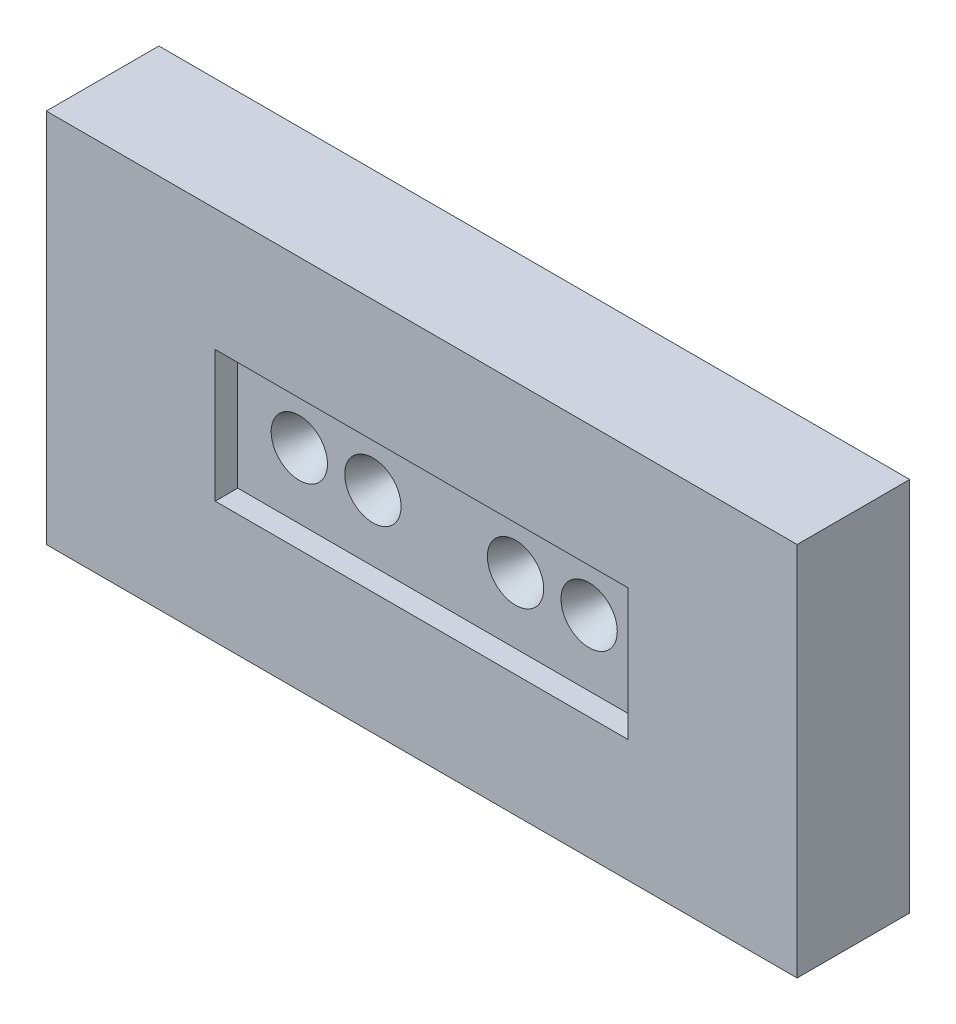
ISO-10303-21;
HEADER;
FILE_DESCRIPTION(('STEP AP214'),'2;1');
FILE_NAME('part.step','',(''),(''),'','','');
FILE_SCHEMA(('AUTOMOTIVE_DESIGN { 1 0 10303 214 1 1 1 1 }'));
ENDSEC;
DATA;
#1=APPLICATION_CONTEXT('core data for automotive mechanical design processes');
#2=APPLICATION_PROTOCOL_DEFINITION('international standard','automotive_design',2000,#1);
#3=PRODUCT_CONTEXT('',#1,'mechanical');
#4=PRODUCT('Part','Part','',(#3));
#5=PRODUCT_RELATED_PRODUCT_CATEGORY('part','',(#4));
#6=PRODUCT_DEFINITION_FORMATION('','',#4);
#7=PRODUCT_DEFINITION_CONTEXT('part definition',#1,'design');
#8=PRODUCT_DEFINITION('design','',#6,#7);
#9=PRODUCT_DEFINITION_SHAPE('','',#8);
#10=(LENGTH_UNIT() NAMED_UNIT(*) SI_UNIT(.MILLI.,.METRE.));
#11=(NAMED_UNIT(*) PLANE_ANGLE_UNIT() SI_UNIT($,.RADIAN.));
#12=(NAMED_UNIT(*) SI_UNIT($,.STERADIAN.) SOLID_ANGLE_UNIT());
#13=UNCERTAINTY_MEASURE_WITH_UNIT(LENGTH_MEASURE(1.E-05),#10,'distance_accuracy_value','');
#14=(GEOMETRIC_REPRESENTATION_CONTEXT(3) GLOBAL_UNCERTAINTY_ASSIGNED_CONTEXT((#13)) GLOBAL_UNIT_ASSIGNED_CONTEXT((#10,
#11,#12)) REPRESENTATION_CONTEXT('',''));
#15=CARTESIAN_POINT('',(0.,0.,0.));
#16=DIRECTION('',(0.,0.,1.));
#17=DIRECTION('',(1.,0.,0.));
#18=AXIS2_PLACEMENT_3D('',#15,#16,#17);
#19=CARTESIAN_POINT('',(20.,10.,6.));
#20=DIRECTION('',(-1.,0.,0.));
#21=DIRECTION('',(0.,-1.,0.));
#22=AXIS2_PLACEMENT_3D('',#19,#20,#21);
#23=PLANE('',#22);
#24=DIRECTION('',(0.,1.,0.));
#25=VECTOR('',#24,1.);
#26=CARTESIAN_POINT('',(20.,10.,0.));
#27=LINE('',#26,#25);
#28=CARTESIAN_POINT('',(20.,-10.,0.));
#29=VERTEX_POINT('',#28);
#30=CARTESIAN_POINT('',(20.,10.,0.));
#31=VERTEX_POINT('',#30);
#32=EDGE_CURVE('E143',#29,#31,#27,.T.);
#33=ORIENTED_EDGE('',*,*,#32,.T.);
#34=DIRECTION('',(0.,0.,-1.));
#35=VECTOR('',#34,1.);
#36=CARTESIAN_POINT('',(20.,10.,6.));
#37=LINE('',#36,#35);
#38=CARTESIAN_POINT('',(20.,10.,6.));
#39=VERTEX_POINT('',#38);
#40=EDGE_CURVE('E11',#39,#31,#37,.T.);
#41=ORIENTED_EDGE('',*,*,#40,.F.);
#42=DIRECTION('',(0.,1.,0.));
#43=VECTOR('',#42,1.);
#44=CARTESIAN_POINT('',(20.,10.,6.));
#45=LINE('',#44,#43);
#46=CARTESIAN_POINT('',(20.,-10.,6.));
#47=VERTEX_POINT('',#46);
#48=EDGE_CURVE('E147',#47,#39,#45,.T.);
#49=ORIENTED_EDGE('',*,*,#48,.F.);
#50=DIRECTION('',(0.,0.,-1.));
#51=VECTOR('',#50,1.);
#52=CARTESIAN_POINT('',(20.,-10.,6.));
#53=LINE('',#52,#51);
#54=EDGE_CURVE('E153',#47,#29,#53,.T.);
#55=ORIENTED_EDGE('',*,*,#54,.T.);
#56=EDGE_LOOP('',(#33,#41,#49,#55));
#57=FACE_BOUND('',#56,.T.);
#58=ADVANCED_FACE('F32',(#57),#23,.F.);
#59=CARTESIAN_POINT('',(-20.,10.,6.));
#60=DIRECTION('',(0.,-1.,0.));
#61=DIRECTION('',(0.,0.,-1.));
#62=AXIS2_PLACEMENT_3D('',#59,#60,#61);
#63=PLANE('',#62);
#64=DIRECTION('',(-1.,0.,0.));
#65=VECTOR('',#64,1.);
#66=CARTESIAN_POINT('',(-20.,10.,0.));
#67=LINE('',#66,#65);
#68=CARTESIAN_POINT('',(-20.,10.,0.));
#69=VERTEX_POINT('',#68);
#70=EDGE_CURVE('E156',#31,#69,#67,.T.);
#71=ORIENTED_EDGE('',*,*,#70,.T.);
#72=DIRECTION('',(0.,0.,-1.));
#73=VECTOR('',#72,1.);
#74=CARTESIAN_POINT('',(-20.,10.,6.));
#75=LINE('',#74,#73);
#76=CARTESIAN_POINT('',(-20.,10.,6.));
#77=VERTEX_POINT('',#76);
#78=EDGE_CURVE('E39',#77,#69,#75,.T.);
#79=ORIENTED_EDGE('',*,*,#78,.F.);
#80=DIRECTION('',(-1.,0.,0.));
#81=VECTOR('',#80,1.);
#82=CARTESIAN_POINT('',(-20.,10.,6.));
#83=LINE('',#82,#81);
#84=EDGE_CURVE('E83',#39,#77,#83,.T.);
#85=ORIENTED_EDGE('',*,*,#84,.F.);
#86=ORIENTED_EDGE('',*,*,#40,.T.);
#87=EDGE_LOOP('',(#71,#79,#85,#86));
#88=FACE_BOUND('',#87,.T.);
#89=ADVANCED_FACE('F185',(#88),#63,.F.);
#90=CARTESIAN_POINT('',(-20.,10.,6.));
#91=DIRECTION('',(1.,0.,0.));
#92=DIRECTION('',(0.,1.,0.));
#93=AXIS2_PLACEMENT_3D('',#90,#91,#92);
#94=PLANE('',#93);
#95=DIRECTION('',(0.,-1.,0.));
#96=VECTOR('',#95,1.);
#97=CARTESIAN_POINT('',(-20.,10.,0.));
#98=LINE('',#97,#96);
#99=CARTESIAN_POINT('',(-20.,-10.,0.));
#100=VERTEX_POINT('',#99);
#101=EDGE_CURVE('E158',#69,#100,#98,.T.);
#102=ORIENTED_EDGE('',*,*,#101,.T.);
#103=DIRECTION('',(0.,0.,-1.));
#104=VECTOR('',#103,1.);
#105=CARTESIAN_POINT('',(-20.,-10.,6.));
#106=LINE('',#105,#104);
#107=CARTESIAN_POINT('',(-20.,-10.,6.));
#108=VERTEX_POINT('',#107);
#109=EDGE_CURVE('E162',#108,#100,#106,.T.);
#110=ORIENTED_EDGE('',*,*,#109,.F.);
#111=DIRECTION('',(0.,-1.,0.));
#112=VECTOR('',#111,1.);
#113=CARTESIAN_POINT('',(-20.,10.,6.));
#114=LINE('',#113,#112);
#115=EDGE_CURVE('E150',#77,#108,#114,.T.);
#116=ORIENTED_EDGE('',*,*,#115,.F.);
#117=ORIENTED_EDGE('',*,*,#78,.T.);
#118=EDGE_LOOP('',(#102,#110,#116,#117));
#119=FACE_BOUND('',#118,.T.);
#120=ADVANCED_FACE('F167',(#119),#94,.F.);
#121=CARTESIAN_POINT('',(-20.,-10.,6.));
#122=DIRECTION('',(0.,1.,0.));
#123=DIRECTION('',(0.,0.,1.));
#124=AXIS2_PLACEMENT_3D('',#121,#122,#123);
#125=PLANE('',#124);
#126=DIRECTION('',(1.,0.,0.));
#127=VECTOR('',#126,1.);
#128=CARTESIAN_POINT('',(-20.,-10.,0.));
#129=LINE('',#128,#127);
#130=EDGE_CURVE('E76',#100,#29,#129,.T.);
#131=ORIENTED_EDGE('',*,*,#130,.T.);
#132=ORIENTED_EDGE('',*,*,#54,.F.);
#133=DIRECTION('',(1.,0.,0.));
#134=VECTOR('',#133,1.);
#135=CARTESIAN_POINT('',(-20.,-10.,6.));
#136=LINE('',#135,#134);
#137=EDGE_CURVE('E55',#108,#47,#136,.T.);
#138=ORIENTED_EDGE('',*,*,#137,.F.);
#139=ORIENTED_EDGE('',*,*,#109,.T.);
#140=EDGE_LOOP('',(#131,#132,#138,#139));
#141=FACE_BOUND('',#140,.T.);
#142=ADVANCED_FACE('F175',(#141),#125,.F.);
#143=CARTESIAN_POINT('',(0.,0.,6.));
#144=DIRECTION('',(0.,0.,1.));
#145=DIRECTION('',(1.,0.,0.));
#146=AXIS2_PLACEMENT_3D('',#143,#144,#145);
#147=PLANE('',#146);
#148=DIRECTION('',(0.,1.,0.));
#149=VECTOR('',#148,1.);
#150=CARTESIAN_POINT('',(11.,3.5,6.));
#151=LINE('',#150,#149);
#152=CARTESIAN_POINT('',(11.,-3.5,6.));
#153=VERTEX_POINT('',#152);
#154=CARTESIAN_POINT('',(11.,3.5,6.));
#155=VERTEX_POINT('',#154);
#156=EDGE_CURVE('E46',#153,#155,#151,.T.);
#157=ORIENTED_EDGE('',*,*,#156,.F.);
#158=DIRECTION('',(1.,0.,0.));
#159=VECTOR('',#158,1.);
#160=CARTESIAN_POINT('',(-11.,-3.5,6.));
#161=LINE('',#160,#159);
#162=CARTESIAN_POINT('',(-11.,-3.5,6.));
#163=VERTEX_POINT('',#162);
#164=EDGE_CURVE('E125',#163,#153,#161,.T.);
#165=ORIENTED_EDGE('',*,*,#164,.F.);
#166=DIRECTION('',(0.,-1.,0.));
#167=VECTOR('',#166,1.);
#168=CARTESIAN_POINT('',(-11.,3.5,6.));
#169=LINE('',#168,#167);
#170=CARTESIAN_POINT('',(-11.,3.5,6.));
#171=VERTEX_POINT('',#170);
#172=EDGE_CURVE('E128',#171,#163,#169,.T.);
#173=ORIENTED_EDGE('',*,*,#172,.F.);
#174=DIRECTION('',(-1.,0.,0.));
#175=VECTOR('',#174,1.);
#176=CARTESIAN_POINT('',(-11.,3.5,6.));
#177=LINE('',#176,#175);
#178=EDGE_CURVE('E137',#155,#171,#177,.T.);
#179=ORIENTED_EDGE('',*,*,#178,.F.);
#180=EDGE_LOOP('',(#157,#165,#173,#179));
#181=FACE_BOUND('',#180,.T.);
#182=ORIENTED_EDGE('',*,*,#48,.T.);
#183=ORIENTED_EDGE('',*,*,#84,.T.);
#184=ORIENTED_EDGE('',*,*,#115,.T.);
#185=ORIENTED_EDGE('',*,*,#137,.T.);
#186=EDGE_LOOP('',(#182,#183,#184,#185));
#187=FACE_BOUND('',#186,.T.);
#188=ADVANCED_FACE('F177',(#181,#187),#147,.T.);
#189=CARTESIAN_POINT('',(0.,0.,0.));
#190=DIRECTION('',(0.,0.,1.));
#191=DIRECTION('',(1.,0.,0.));
#192=AXIS2_PLACEMENT_3D('',#189,#190,#191);
#193=PLANE('',#192);
#194=CARTESIAN_POINT('',(-3.8,0.,0.));
#195=DIRECTION('',(0.,0.,1.));
#196=DIRECTION('',(1.,0.,0.));
#197=AXIS2_PLACEMENT_3D('',#194,#195,#196);
#198=CIRCLE('',#197,0.3);
#199=CARTESIAN_POINT('',(-3.5,0.,0.));
#200=VERTEX_POINT('',#199);
#201=EDGE_CURVE('E400',#200,#200,#198,.T.);
#202=ORIENTED_EDGE('',*,*,#201,.T.);
#203=EDGE_LOOP('',(#202));
#204=FACE_BOUND('',#203,.T.);
#205=CARTESIAN_POINT('',(3.8,0.,0.));
#206=DIRECTION('',(0.,0.,1.));
#207=DIRECTION('',(1.,0.,0.));
#208=AXIS2_PLACEMENT_3D('',#205,#206,#207);
#209=CIRCLE('',#208,0.300000000000001);
#210=CARTESIAN_POINT('',(4.1,0.,0.));
#211=VERTEX_POINT('',#210);
#212=EDGE_CURVE('E394',#211,#211,#209,.T.);
#213=ORIENTED_EDGE('',*,*,#212,.T.);
#214=EDGE_LOOP('',(#213));
#215=FACE_BOUND('',#214,.T.);
#216=CARTESIAN_POINT('',(7.72,0.,0.));
#217=DIRECTION('',(0.,0.,1.));
#218=DIRECTION('',(1.,0.,0.));
#219=AXIS2_PLACEMENT_3D('',#216,#217,#218);
#220=CIRCLE('',#219,0.3);
#221=CARTESIAN_POINT('',(8.02,0.,0.));
#222=VERTEX_POINT('',#221);
#223=EDGE_CURVE('E391',#222,#222,#220,.T.);
#224=ORIENTED_EDGE('',*,*,#223,.T.);
#225=EDGE_LOOP('',(#224));
#226=FACE_BOUND('',#225,.T.);
#227=CARTESIAN_POINT('',(-7.72,0.,0.));
#228=DIRECTION('',(0.,0.,1.));
#229=DIRECTION('',(1.,0.,0.));
#230=AXIS2_PLACEMENT_3D('',#227,#228,#229);
#231=CIRCLE('',#230,0.3);
#232=CARTESIAN_POINT('',(-7.42,0.,0.));
#233=VERTEX_POINT('',#232);
#234=EDGE_CURVE('E397',#233,#233,#231,.T.);
#235=ORIENTED_EDGE('',*,*,#234,.T.);
#236=EDGE_LOOP('',(#235));
#237=FACE_BOUND('',#236,.T.);
#238=ORIENTED_EDGE('',*,*,#32,.F.);
#239=ORIENTED_EDGE('',*,*,#130,.F.);
#240=ORIENTED_EDGE('',*,*,#101,.F.);
#241=ORIENTED_EDGE('',*,*,#70,.F.);
#242=EDGE_LOOP('',(#238,#239,#240,#241));
#243=FACE_BOUND('',#242,.T.);
#244=ADVANCED_FACE('F171',(#204,#215,#226,#237,#243),#193,.F.);
#245=CARTESIAN_POINT('',(11.,3.5,4.8));
#246=DIRECTION('',(1.,0.,0.));
#247=DIRECTION('',(0.,0.,-1.));
#248=AXIS2_PLACEMENT_3D('',#245,#246,#247);
#249=PLANE('',#248);
#250=ORIENTED_EDGE('',*,*,#156,.T.);
#251=DIRECTION('',(0.,0.,1.));
#252=VECTOR('',#251,1.);
#253=CARTESIAN_POINT('',(11.,3.5,4.8));
#254=LINE('',#253,#252);
#255=CARTESIAN_POINT('',(11.,3.5,4.8));
#256=VERTEX_POINT('',#255);
#257=EDGE_CURVE('E103',#256,#155,#254,.T.);
#258=ORIENTED_EDGE('',*,*,#257,.F.);
#259=DIRECTION('',(0.,1.,0.));
#260=VECTOR('',#259,1.);
#261=CARTESIAN_POINT('',(11.,3.5,4.8));
#262=LINE('',#261,#260);
#263=CARTESIAN_POINT('',(11.,-3.5,4.8));
#264=VERTEX_POINT('',#263);
#265=EDGE_CURVE('E107',#264,#256,#262,.T.);
#266=ORIENTED_EDGE('',*,*,#265,.F.);
#267=DIRECTION('',(0.,0.,1.));
#268=VECTOR('',#267,1.);
#269=CARTESIAN_POINT('',(11.,-3.5,4.8));
#270=LINE('',#269,#268);
#271=EDGE_CURVE('E141',#264,#153,#270,.T.);
#272=ORIENTED_EDGE('',*,*,#271,.T.);
#273=EDGE_LOOP('',(#250,#258,#266,#272));
#274=FACE_BOUND('',#273,.T.);
#275=ADVANCED_FACE('F105',(#274),#249,.F.);
#276=CARTESIAN_POINT('',(-11.,-3.5,4.8));
#277=DIRECTION('',(0.,-1.,0.));
#278=DIRECTION('',(0.,0.,-1.));
#279=AXIS2_PLACEMENT_3D('',#276,#277,#278);
#280=PLANE('',#279);
#281=ORIENTED_EDGE('',*,*,#164,.T.);
#282=ORIENTED_EDGE('',*,*,#271,.F.);
#283=DIRECTION('',(1.,0.,0.));
#284=VECTOR('',#283,1.);
#285=CARTESIAN_POINT('',(-11.,-3.5,4.8));
#286=LINE('',#285,#284);
#287=CARTESIAN_POINT('',(-11.,-3.5,4.8));
#288=VERTEX_POINT('',#287);
#289=EDGE_CURVE('E113',#288,#264,#286,.T.);
#290=ORIENTED_EDGE('',*,*,#289,.F.);
#291=DIRECTION('',(0.,0.,1.));
#292=VECTOR('',#291,1.);
#293=CARTESIAN_POINT('',(-11.,-3.5,4.8));
#294=LINE('',#293,#292);
#295=EDGE_CURVE('E144',#288,#163,#294,.T.);
#296=ORIENTED_EDGE('',*,*,#295,.T.);
#297=EDGE_LOOP('',(#281,#282,#290,#296));
#298=FACE_BOUND('',#297,.T.);
#299=ADVANCED_FACE('F219',(#298),#280,.F.);
#300=CARTESIAN_POINT('',(-11.,3.5,4.8));
#301=DIRECTION('',(-1.,0.,0.));
#302=DIRECTION('',(0.,0.,1.));
#303=AXIS2_PLACEMENT_3D('',#300,#301,#302);
#304=PLANE('',#303);
#305=ORIENTED_EDGE('',*,*,#172,.T.);
#306=ORIENTED_EDGE('',*,*,#295,.F.);
#307=DIRECTION('',(0.,-1.,0.));
#308=VECTOR('',#307,1.);
#309=CARTESIAN_POINT('',(-11.,3.5,4.8));
#310=LINE('',#309,#308);
#311=CARTESIAN_POINT('',(-11.,3.5,4.8));
#312=VERTEX_POINT('',#311);
#313=EDGE_CURVE('E121',#312,#288,#310,.T.);
#314=ORIENTED_EDGE('',*,*,#313,.F.);
#315=DIRECTION('',(0.,0.,1.));
#316=VECTOR('',#315,1.);
#317=CARTESIAN_POINT('',(-11.,3.5,4.8));
#318=LINE('',#317,#316);
#319=EDGE_CURVE('E112',#312,#171,#318,.T.);
#320=ORIENTED_EDGE('',*,*,#319,.T.);
#321=EDGE_LOOP('',(#305,#306,#314,#320));
#322=FACE_BOUND('',#321,.T.);
#323=ADVANCED_FACE('F228',(#322),#304,.F.);
#324=CARTESIAN_POINT('',(-11.,3.5,4.8));
#325=DIRECTION('',(0.,1.,0.));
#326=DIRECTION('',(0.,0.,1.));
#327=AXIS2_PLACEMENT_3D('',#324,#325,#326);
#328=PLANE('',#327);
#329=ORIENTED_EDGE('',*,*,#178,.T.);
#330=ORIENTED_EDGE('',*,*,#319,.F.);
#331=DIRECTION('',(-1.,0.,0.));
#332=VECTOR('',#331,1.);
#333=CARTESIAN_POINT('',(-11.,3.5,4.8));
#334=LINE('',#333,#332);
#335=EDGE_CURVE('E116',#256,#312,#334,.T.);
#336=ORIENTED_EDGE('',*,*,#335,.F.);
#337=ORIENTED_EDGE('',*,*,#257,.T.);
#338=EDGE_LOOP('',(#329,#330,#336,#337));
#339=FACE_BOUND('',#338,.T.);
#340=ADVANCED_FACE('F117',(#339),#328,.F.);
#341=CARTESIAN_POINT('',(0.,0.,4.8));
#342=DIRECTION('',(0.,0.,1.));
#343=DIRECTION('',(1.,0.,0.));
#344=AXIS2_PLACEMENT_3D('',#341,#342,#343);
#345=PLANE('',#344);
#346=CARTESIAN_POINT('',(-3.8,0.,4.8));
#347=DIRECTION('',(0.,0.,1.));
#348=DIRECTION('',(1.,0.,0.));
#349=AXIS2_PLACEMENT_3D('',#346,#347,#348);
#350=CIRCLE('',#349,1.5);
#351=CARTESIAN_POINT('',(-2.3,0.,4.8));
#352=VERTEX_POINT('',#351);
#353=EDGE_CURVE('E407',#352,#352,#350,.T.);
#354=ORIENTED_EDGE('',*,*,#353,.F.);
#355=EDGE_LOOP('',(#354));
#356=FACE_BOUND('',#355,.T.);
#357=CARTESIAN_POINT('',(3.8,0.,4.8));
#358=DIRECTION('',(0.,0.,1.));
#359=DIRECTION('',(1.,0.,0.));
#360=AXIS2_PLACEMENT_3D('',#357,#358,#359);
#361=CIRCLE('',#360,1.5);
#362=CARTESIAN_POINT('',(5.3,0.,4.8));
#363=VERTEX_POINT('',#362);
#364=EDGE_CURVE('E415',#363,#363,#361,.T.);
#365=ORIENTED_EDGE('',*,*,#364,.F.);
#366=EDGE_LOOP('',(#365));
#367=FACE_BOUND('',#366,.T.);
#368=CARTESIAN_POINT('',(7.72,0.,4.8));
#369=DIRECTION('',(0.,0.,1.));
#370=DIRECTION('',(1.,0.,0.));
#371=AXIS2_PLACEMENT_3D('',#368,#369,#370);
#372=CIRCLE('',#371,1.5);
#373=CARTESIAN_POINT('',(9.22,0.,4.8));
#374=VERTEX_POINT('',#373);
#375=EDGE_CURVE('E406',#374,#374,#372,.T.);
#376=ORIENTED_EDGE('',*,*,#375,.F.);
#377=EDGE_LOOP('',(#376));
#378=FACE_BOUND('',#377,.T.);
#379=CARTESIAN_POINT('',(-7.72,0.,4.8));
#380=DIRECTION('',(0.,0.,1.));
#381=DIRECTION('',(1.,0.,0.));
#382=AXIS2_PLACEMENT_3D('',#379,#380,#381);
#383=CIRCLE('',#382,1.5);
#384=CARTESIAN_POINT('',(-6.22,0.,4.8));
#385=VERTEX_POINT('',#384);
#386=EDGE_CURVE('E414',#385,#385,#383,.T.);
#387=ORIENTED_EDGE('',*,*,#386,.F.);
#388=EDGE_LOOP('',(#387));
#389=FACE_BOUND('',#388,.T.);
#390=ORIENTED_EDGE('',*,*,#265,.T.);
#391=ORIENTED_EDGE('',*,*,#335,.T.);
#392=ORIENTED_EDGE('',*,*,#313,.T.);
#393=ORIENTED_EDGE('',*,*,#289,.T.);
#394=EDGE_LOOP('',(#390,#391,#392,#393));
#395=FACE_BOUND('',#394,.T.);
#396=ADVANCED_FACE('F123',(#356,#367,#378,#389,#395),#345,.T.);
#397=CARTESIAN_POINT('',(-7.72,0.,4.8));
#398=DIRECTION('',(0.,0.,1.));
#399=DIRECTION('',(1.,0.,0.));
#400=AXIS2_PLACEMENT_3D('',#397,#398,#399);
#401=CONICAL_SURFACE('',#400,1.5,0.401425727958696);
#402=CARTESIAN_POINT('',(-7.72,0.,2.));
#403=DIRECTION('',(0.,0.,1.));
#404=DIRECTION('',(1.,0.,0.));
#405=AXIS2_PLACEMENT_3D('',#402,#403,#404);
#406=CIRCLE('',#405,0.311470514613106);
#407=CARTESIAN_POINT('',(-7.40852948538689,0.,2.));
#408=VERTEX_POINT('',#407);
#409=EDGE_CURVE('E131',#408,#408,#406,.T.);
#410=ORIENTED_EDGE('',*,*,#409,.F.);
#411=EDGE_LOOP('',(#410));
#412=FACE_BOUND('',#411,.T.);
#413=ORIENTED_EDGE('',*,*,#386,.T.);
#414=EDGE_LOOP('',(#413));
#415=FACE_BOUND('',#414,.T.);
#416=ADVANCED_FACE('F255',(#412,#415),#401,.F.);
#417=CARTESIAN_POINT('',(-7.72,0.,2.));
#418=DIRECTION('',(0.,0.,1.));
#419=DIRECTION('',(1.,0.,0.));
#420=AXIS2_PLACEMENT_3D('',#417,#418,#419);
#421=PLANE('',#420);
#422=CARTESIAN_POINT('',(-7.72,0.,2.));
#423=DIRECTION('',(0.,0.,1.));
#424=DIRECTION('',(1.,0.,0.));
#425=AXIS2_PLACEMENT_3D('',#422,#423,#424);
#426=CIRCLE('',#425,0.3);
#427=CARTESIAN_POINT('',(-7.42,0.,2.));
#428=VERTEX_POINT('',#427);
#429=EDGE_CURVE('E393',#428,#428,#426,.T.);
#430=ORIENTED_EDGE('',*,*,#429,.F.);
#431=EDGE_LOOP('',(#430));
#432=FACE_BOUND('',#431,.T.);
#433=ORIENTED_EDGE('',*,*,#409,.T.);
#434=EDGE_LOOP('',(#433));
#435=FACE_BOUND('',#434,.T.);
#436=ADVANCED_FACE('F265',(#432,#435),#421,.T.);
#437=CARTESIAN_POINT('',(7.72,0.,4.8));
#438=DIRECTION('',(0.,0.,1.));
#439=DIRECTION('',(1.,0.,0.));
#440=AXIS2_PLACEMENT_3D('',#437,#438,#439);
#441=CONICAL_SURFACE('',#440,1.5,0.401425727958696);
#442=CARTESIAN_POINT('',(7.72,0.,2.));
#443=DIRECTION('',(0.,0.,1.));
#444=DIRECTION('',(1.,0.,0.));
#445=AXIS2_PLACEMENT_3D('',#442,#443,#444);
#446=CIRCLE('',#445,0.311470514613105);
#447=CARTESIAN_POINT('',(8.0314705146131,0.,2.));
#448=VERTEX_POINT('',#447);
#449=EDGE_CURVE('E418',#448,#448,#446,.T.);
#450=ORIENTED_EDGE('',*,*,#449,.F.);
#451=EDGE_LOOP('',(#450));
#452=FACE_BOUND('',#451,.T.);
#453=ORIENTED_EDGE('',*,*,#375,.T.);
#454=EDGE_LOOP('',(#453));
#455=FACE_BOUND('',#454,.T.);
#456=ADVANCED_FACE('F273',(#452,#455),#441,.F.);
#457=CARTESIAN_POINT('',(7.72,0.,2.));
#458=DIRECTION('',(0.,0.,1.));
#459=DIRECTION('',(1.,0.,0.));
#460=AXIS2_PLACEMENT_3D('',#457,#458,#459);
#461=PLANE('',#460);
#462=CARTESIAN_POINT('',(7.72,0.,2.));
#463=DIRECTION('',(0.,0.,1.));
#464=DIRECTION('',(1.,0.,0.));
#465=AXIS2_PLACEMENT_3D('',#462,#463,#464);
#466=CIRCLE('',#465,0.3);
#467=CARTESIAN_POINT('',(8.02,0.,2.));
#468=VERTEX_POINT('',#467);
#469=EDGE_CURVE('E388',#468,#468,#466,.T.);
#470=ORIENTED_EDGE('',*,*,#469,.F.);
#471=EDGE_LOOP('',(#470));
#472=FACE_BOUND('',#471,.T.);
#473=ORIENTED_EDGE('',*,*,#449,.T.);
#474=EDGE_LOOP('',(#473));
#475=FACE_BOUND('',#474,.T.);
#476=ADVANCED_FACE('F278',(#472,#475),#461,.T.);
#477=CARTESIAN_POINT('',(3.8,0.,4.8));
#478=DIRECTION('',(0.,0.,1.));
#479=DIRECTION('',(1.,0.,0.));
#480=AXIS2_PLACEMENT_3D('',#477,#478,#479);
#481=CONICAL_SURFACE('',#480,1.5,0.401425727958696);
#482=CARTESIAN_POINT('',(3.8,0.,2.));
#483=DIRECTION('',(0.,0.,1.));
#484=DIRECTION('',(1.,0.,0.));
#485=AXIS2_PLACEMENT_3D('',#482,#483,#484);
#486=CIRCLE('',#485,0.311470514613105);
#487=CARTESIAN_POINT('',(4.11147051461311,0.,2.));
#488=VERTEX_POINT('',#487);
#489=EDGE_CURVE('E411',#488,#488,#486,.T.);
#490=ORIENTED_EDGE('',*,*,#489,.F.);
#491=EDGE_LOOP('',(#490));
#492=FACE_BOUND('',#491,.T.);
#493=ORIENTED_EDGE('',*,*,#364,.T.);
#494=EDGE_LOOP('',(#493));
#495=FACE_BOUND('',#494,.T.);
#496=ADVANCED_FACE('F286',(#492,#495),#481,.F.);
#497=CARTESIAN_POINT('',(3.8,0.,2.));
#498=DIRECTION('',(0.,0.,1.));
#499=DIRECTION('',(1.,0.,0.));
#500=AXIS2_PLACEMENT_3D('',#497,#498,#499);
#501=PLANE('',#500);
#502=CARTESIAN_POINT('',(3.8,0.,2.));
#503=DIRECTION('',(0.,0.,1.));
#504=DIRECTION('',(1.,0.,0.));
#505=AXIS2_PLACEMENT_3D('',#502,#503,#504);
#506=CIRCLE('',#505,0.300000000000001);
#507=CARTESIAN_POINT('',(4.1,0.,2.));
#508=VERTEX_POINT('',#507);
#509=EDGE_CURVE('E452',#508,#508,#506,.T.);
#510=ORIENTED_EDGE('',*,*,#509,.F.);
#511=EDGE_LOOP('',(#510));
#512=FACE_BOUND('',#511,.T.);
#513=ORIENTED_EDGE('',*,*,#489,.T.);
#514=EDGE_LOOP('',(#513));
#515=FACE_BOUND('',#514,.T.);
#516=ADVANCED_FACE('F291',(#512,#515),#501,.T.);
#517=CARTESIAN_POINT('',(-3.8,0.,4.8));
#518=DIRECTION('',(0.,0.,1.));
#519=DIRECTION('',(1.,0.,0.));
#520=AXIS2_PLACEMENT_3D('',#517,#518,#519);
#521=CONICAL_SURFACE('',#520,1.5,0.401425727958696);
#522=CARTESIAN_POINT('',(-3.8,0.,2.));
#523=DIRECTION('',(0.,0.,1.));
#524=DIRECTION('',(1.,0.,0.));
#525=AXIS2_PLACEMENT_3D('',#522,#523,#524);
#526=CIRCLE('',#525,0.311470514613106);
#527=CARTESIAN_POINT('',(-3.48852948538689,0.,2.));
#528=VERTEX_POINT('',#527);
#529=EDGE_CURVE('E410',#528,#528,#526,.T.);
#530=ORIENTED_EDGE('',*,*,#529,.F.);
#531=EDGE_LOOP('',(#530));
#532=FACE_BOUND('',#531,.T.);
#533=ORIENTED_EDGE('',*,*,#353,.T.);
#534=EDGE_LOOP('',(#533));
#535=FACE_BOUND('',#534,.T.);
#536=ADVANCED_FACE('F299',(#532,#535),#521,.F.);
#537=CARTESIAN_POINT('',(-3.8,0.,2.));
#538=DIRECTION('',(0.,0.,1.));
#539=DIRECTION('',(1.,0.,0.));
#540=AXIS2_PLACEMENT_3D('',#537,#538,#539);
#541=PLANE('',#540);
#542=CARTESIAN_POINT('',(-3.8,0.,2.));
#543=DIRECTION('',(0.,0.,1.));
#544=DIRECTION('',(1.,0.,0.));
#545=AXIS2_PLACEMENT_3D('',#542,#543,#544);
#546=CIRCLE('',#545,0.3);
#547=CARTESIAN_POINT('',(-3.5,0.,2.));
#548=VERTEX_POINT('',#547);
#549=EDGE_CURVE('E450',#548,#548,#546,.T.);
#550=ORIENTED_EDGE('',*,*,#549,.F.);
#551=EDGE_LOOP('',(#550));
#552=FACE_BOUND('',#551,.T.);
#553=ORIENTED_EDGE('',*,*,#529,.T.);
#554=EDGE_LOOP('',(#553));
#555=FACE_BOUND('',#554,.T.);
#556=ADVANCED_FACE('F304',(#552,#555),#541,.T.);
#557=CARTESIAN_POINT('',(-7.72,0.,-0.5));
#558=DIRECTION('',(0.,0.,1.));
#559=DIRECTION('',(1.,0.,0.));
#560=AXIS2_PLACEMENT_3D('',#557,#558,#559);
#561=CYLINDRICAL_SURFACE('',#560,0.3);
#562=ORIENTED_EDGE('',*,*,#429,.T.);
#563=EDGE_LOOP('',(#562));
#564=FACE_BOUND('',#563,.T.);
#565=ORIENTED_EDGE('',*,*,#234,.F.);
#566=EDGE_LOOP('',(#565));
#567=FACE_BOUND('',#566,.T.);
#568=ADVANCED_FACE('F341',(#564,#567),#561,.F.);
#569=CARTESIAN_POINT('',(-3.8,0.,-0.5));
#570=DIRECTION('',(0.,0.,1.));
#571=DIRECTION('',(1.,0.,0.));
#572=AXIS2_PLACEMENT_3D('',#569,#570,#571);
#573=CYLINDRICAL_SURFACE('',#572,0.3);
#574=ORIENTED_EDGE('',*,*,#549,.T.);
#575=EDGE_LOOP('',(#574));
#576=FACE_BOUND('',#575,.T.);
#577=ORIENTED_EDGE('',*,*,#201,.F.);
#578=EDGE_LOOP('',(#577));
#579=FACE_BOUND('',#578,.T.);
#580=ADVANCED_FACE('F351',(#576,#579),#573,.F.);
#581=CARTESIAN_POINT('',(3.8,0.,-0.5));
#582=DIRECTION('',(0.,0.,1.));
#583=DIRECTION('',(1.,0.,0.));
#584=AXIS2_PLACEMENT_3D('',#581,#582,#583);
#585=CYLINDRICAL_SURFACE('',#584,0.300000000000001);
#586=ORIENTED_EDGE('',*,*,#509,.T.);
#587=EDGE_LOOP('',(#586));
#588=FACE_BOUND('',#587,.T.);
#589=ORIENTED_EDGE('',*,*,#212,.F.);
#590=EDGE_LOOP('',(#589));
#591=FACE_BOUND('',#590,.T.);
#592=ADVANCED_FACE('F361',(#588,#591),#585,.F.);
#593=CARTESIAN_POINT('',(7.72,0.,-0.5));
#594=DIRECTION('',(0.,0.,1.));
#595=DIRECTION('',(1.,0.,0.));
#596=AXIS2_PLACEMENT_3D('',#593,#594,#595);
#597=CYLINDRICAL_SURFACE('',#596,0.3);
#598=ORIENTED_EDGE('',*,*,#469,.T.);
#599=EDGE_LOOP('',(#598));
#600=FACE_BOUND('',#599,.T.);
#601=ORIENTED_EDGE('',*,*,#223,.F.);
#602=EDGE_LOOP('',(#601));
#603=FACE_BOUND('',#602,.T.);
#604=ADVANCED_FACE('F371',(#600,#603),#597,.F.);
#605=CLOSED_SHELL('',(#58,#89,#120,#142,#188,#244,#275,#299,#323,#340,#396,#416,#436,#456,#476,
#496,#516,#536,#556,#568,#580,#592,#604));
#606=MANIFOLD_SOLID_BREP('B2',#605);
#607=ADVANCED_BREP_SHAPE_REPRESENTATION('',(#18,#606),#14);
#608=SHAPE_DEFINITION_REPRESENTATION(#9,#607);
ENDSEC;
END-ISO-10303-21;
